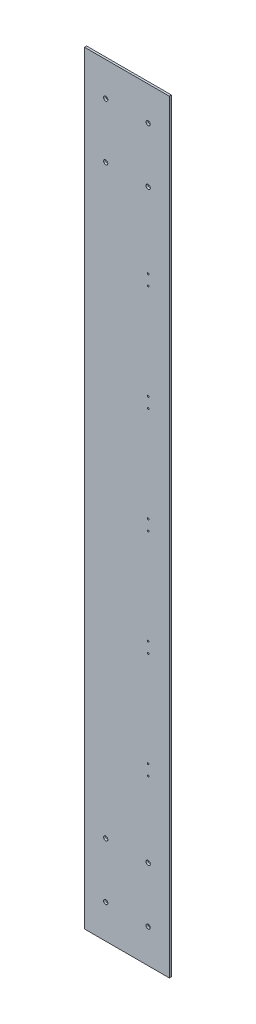
ISO-10303-21;
HEADER;
FILE_DESCRIPTION(('STEP AP214'),'2;1');
FILE_NAME('part.step','',(''),(''),'','','');
FILE_SCHEMA(('AUTOMOTIVE_DESIGN { 1 0 10303 214 1 1 1 1 }'));
ENDSEC;
DATA;
#1=APPLICATION_CONTEXT('core data for automotive mechanical design processes');
#2=APPLICATION_PROTOCOL_DEFINITION('international standard','automotive_design',2000,#1);
#3=PRODUCT_CONTEXT('',#1,'mechanical');
#4=PRODUCT('Part','Part','',(#3));
#5=PRODUCT_RELATED_PRODUCT_CATEGORY('part','',(#4));
#6=PRODUCT_DEFINITION_FORMATION('','',#4);
#7=PRODUCT_DEFINITION_CONTEXT('part definition',#1,'design');
#8=PRODUCT_DEFINITION('design','',#6,#7);
#9=PRODUCT_DEFINITION_SHAPE('','',#8);
#10=(LENGTH_UNIT() NAMED_UNIT(*) SI_UNIT(.MILLI.,.METRE.));
#11=(NAMED_UNIT(*) PLANE_ANGLE_UNIT() SI_UNIT($,.RADIAN.));
#12=(NAMED_UNIT(*) SI_UNIT($,.STERADIAN.) SOLID_ANGLE_UNIT());
#13=UNCERTAINTY_MEASURE_WITH_UNIT(LENGTH_MEASURE(1.E-05),#10,'distance_accuracy_value','');
#14=(GEOMETRIC_REPRESENTATION_CONTEXT(3) GLOBAL_UNCERTAINTY_ASSIGNED_CONTEXT((#13)) GLOBAL_UNIT_ASSIGNED_CONTEXT((#10,
#11,#12)) REPRESENTATION_CONTEXT('',''));
#15=CARTESIAN_POINT('',(0.,0.,0.));
#16=DIRECTION('',(0.,0.,1.));
#17=DIRECTION('',(1.,0.,0.));
#18=AXIS2_PLACEMENT_3D('',#15,#16,#17);
#19=CARTESIAN_POINT('',(100.,900.,5.));
#20=DIRECTION('',(0.,-1.,0.));
#21=DIRECTION('',(0.,0.,-1.));
#22=AXIS2_PLACEMENT_3D('',#19,#20,#21);
#23=PLANE('',#22);
#24=DIRECTION('',(-1.,0.,0.));
#25=VECTOR('',#24,1.);
#26=CARTESIAN_POINT('',(100.,900.,0.));
#27=LINE('',#26,#25);
#28=CARTESIAN_POINT('',(100.,900.,0.));
#29=VERTEX_POINT('',#28);
#30=CARTESIAN_POINT('',(-100.,900.,0.));
#31=VERTEX_POINT('',#30);
#32=EDGE_CURVE('E107',#29,#31,#27,.T.);
#33=ORIENTED_EDGE('',*,*,#32,.T.);
#34=DIRECTION('',(0.,0.,-1.));
#35=VECTOR('',#34,1.);
#36=CARTESIAN_POINT('',(-100.,900.,5.));
#37=LINE('',#36,#35);
#38=CARTESIAN_POINT('',(-100.,900.,5.));
#39=VERTEX_POINT('',#38);
#40=EDGE_CURVE('E11',#39,#31,#37,.T.);
#41=ORIENTED_EDGE('',*,*,#40,.F.);
#42=DIRECTION('',(-1.,0.,0.));
#43=VECTOR('',#42,1.);
#44=CARTESIAN_POINT('',(100.,900.,5.));
#45=LINE('',#44,#43);
#46=CARTESIAN_POINT('',(100.,900.,5.));
#47=VERTEX_POINT('',#46);
#48=EDGE_CURVE('E91',#47,#39,#45,.T.);
#49=ORIENTED_EDGE('',*,*,#48,.F.);
#50=DIRECTION('',(0.,0.,-1.));
#51=VECTOR('',#50,1.);
#52=CARTESIAN_POINT('',(100.,900.,5.));
#53=LINE('',#52,#51);
#54=EDGE_CURVE('E103',#47,#29,#53,.T.);
#55=ORIENTED_EDGE('',*,*,#54,.T.);
#56=EDGE_LOOP('',(#33,#41,#49,#55));
#57=FACE_BOUND('',#56,.T.);
#58=ADVANCED_FACE('F39',(#57),#23,.F.);
#59=CARTESIAN_POINT('',(-100.,900.,5.));
#60=DIRECTION('',(1.,0.,0.));
#61=DIRECTION('',(0.,0.,-1.));
#62=AXIS2_PLACEMENT_3D('',#59,#60,#61);
#63=PLANE('',#62);
#64=DIRECTION('',(0.,-1.,0.));
#65=VECTOR('',#64,1.);
#66=CARTESIAN_POINT('',(-100.,900.,0.));
#67=LINE('',#66,#65);
#68=CARTESIAN_POINT('',(-100.,-900.,0.));
#69=VERTEX_POINT('',#68);
#70=EDGE_CURVE('E96',#31,#69,#67,.T.);
#71=ORIENTED_EDGE('',*,*,#70,.T.);
#72=DIRECTION('',(0.,0.,-1.));
#73=VECTOR('',#72,1.);
#74=CARTESIAN_POINT('',(-100.,-900.,5.));
#75=LINE('',#74,#73);
#76=CARTESIAN_POINT('',(-100.,-900.,5.));
#77=VERTEX_POINT('',#76);
#78=EDGE_CURVE('E48',#77,#69,#75,.T.);
#79=ORIENTED_EDGE('',*,*,#78,.F.);
#80=DIRECTION('',(0.,-1.,0.));
#81=VECTOR('',#80,1.);
#82=CARTESIAN_POINT('',(-100.,900.,5.));
#83=LINE('',#82,#81);
#84=EDGE_CURVE('E86',#39,#77,#83,.T.);
#85=ORIENTED_EDGE('',*,*,#84,.F.);
#86=ORIENTED_EDGE('',*,*,#40,.T.);
#87=EDGE_LOOP('',(#71,#79,#85,#86));
#88=FACE_BOUND('',#87,.T.);
#89=ADVANCED_FACE('F95',(#88),#63,.F.);
#90=CARTESIAN_POINT('',(-100.,-900.,5.));
#91=DIRECTION('',(0.,1.,0.));
#92=DIRECTION('',(0.,0.,1.));
#93=AXIS2_PLACEMENT_3D('',#90,#91,#92);
#94=PLANE('',#93);
#95=DIRECTION('',(1.,0.,0.));
#96=VECTOR('',#95,1.);
#97=CARTESIAN_POINT('',(-100.,-900.,0.));
#98=LINE('',#97,#96);
#99=CARTESIAN_POINT('',(100.,-900.,0.));
#100=VERTEX_POINT('',#99);
#101=EDGE_CURVE('E73',#69,#100,#98,.T.);
#102=ORIENTED_EDGE('',*,*,#101,.T.);
#103=DIRECTION('',(0.,0.,-1.));
#104=VECTOR('',#103,1.);
#105=CARTESIAN_POINT('',(100.,-900.,5.));
#106=LINE('',#105,#104);
#107=CARTESIAN_POINT('',(100.,-900.,5.));
#108=VERTEX_POINT('',#107);
#109=EDGE_CURVE('E98',#108,#100,#106,.T.);
#110=ORIENTED_EDGE('',*,*,#109,.F.);
#111=DIRECTION('',(1.,0.,0.));
#112=VECTOR('',#111,1.);
#113=CARTESIAN_POINT('',(-100.,-900.,5.));
#114=LINE('',#113,#112);
#115=EDGE_CURVE('E89',#77,#108,#114,.T.);
#116=ORIENTED_EDGE('',*,*,#115,.F.);
#117=ORIENTED_EDGE('',*,*,#78,.T.);
#118=EDGE_LOOP('',(#102,#110,#116,#117));
#119=FACE_BOUND('',#118,.T.);
#120=ADVANCED_FACE('F99',(#119),#94,.F.);
#121=CARTESIAN_POINT('',(100.,-900.,5.));
#122=DIRECTION('',(-1.,0.,0.));
#123=DIRECTION('',(0.,0.,1.));
#124=AXIS2_PLACEMENT_3D('',#121,#122,#123);
#125=PLANE('',#124);
#126=DIRECTION('',(0.,1.,0.));
#127=VECTOR('',#126,1.);
#128=CARTESIAN_POINT('',(100.,-900.,0.));
#129=LINE('',#128,#127);
#130=EDGE_CURVE('E79',#100,#29,#129,.T.);
#131=ORIENTED_EDGE('',*,*,#130,.T.);
#132=ORIENTED_EDGE('',*,*,#54,.F.);
#133=DIRECTION('',(0.,1.,0.));
#134=VECTOR('',#133,1.);
#135=CARTESIAN_POINT('',(100.,-900.,5.));
#136=LINE('',#135,#134);
#137=EDGE_CURVE('E56',#108,#47,#136,.T.);
#138=ORIENTED_EDGE('',*,*,#137,.F.);
#139=ORIENTED_EDGE('',*,*,#109,.T.);
#140=EDGE_LOOP('',(#131,#132,#138,#139));
#141=FACE_BOUND('',#140,.T.);
#142=ADVANCED_FACE('F121',(#141),#125,.F.);
#143=CARTESIAN_POINT('',(0.,0.,5.));
#144=DIRECTION('',(0.,0.,1.));
#145=DIRECTION('',(1.,0.,0.));
#146=AXIS2_PLACEMENT_3D('',#143,#144,#145);
#147=PLANE('',#146);
#148=CARTESIAN_POINT('',(50.,-487.5,5.));
#149=DIRECTION('',(0.,0.,1.));
#150=DIRECTION('',(-1.,0.,0.));
#151=AXIS2_PLACEMENT_3D('',#148,#149,#150);
#152=CIRCLE('',#151,2.);
#153=CARTESIAN_POINT('',(48.,-487.5,5.));
#154=VERTEX_POINT('',#153);
#155=EDGE_CURVE('E200',#154,#154,#152,.T.);
#156=ORIENTED_EDGE('',*,*,#155,.F.);
#157=EDGE_LOOP('',(#156));
#158=FACE_BOUND('',#157,.T.);
#159=CARTESIAN_POINT('',(50.,-262.5,5.));
#160=DIRECTION('',(0.,0.,1.));
#161=DIRECTION('',(-1.,0.,0.));
#162=AXIS2_PLACEMENT_3D('',#159,#160,#161);
#163=CIRCLE('',#162,2.00000000000002);
#164=CARTESIAN_POINT('',(48.,-262.5,5.));
#165=VERTEX_POINT('',#164);
#166=EDGE_CURVE('E209',#165,#165,#163,.T.);
#167=ORIENTED_EDGE('',*,*,#166,.F.);
#168=EDGE_LOOP('',(#167));
#169=FACE_BOUND('',#168,.T.);
#170=CARTESIAN_POINT('',(50.,-237.5,5.));
#171=DIRECTION('',(0.,0.,1.));
#172=DIRECTION('',(-1.,0.,0.));
#173=AXIS2_PLACEMENT_3D('',#170,#171,#172);
#174=CIRCLE('',#173,2.);
#175=CARTESIAN_POINT('',(48.,-237.5,5.));
#176=VERTEX_POINT('',#175);
#177=EDGE_CURVE('E217',#176,#176,#174,.T.);
#178=ORIENTED_EDGE('',*,*,#177,.F.);
#179=EDGE_LOOP('',(#178));
#180=FACE_BOUND('',#179,.T.);
#181=CARTESIAN_POINT('',(50.,-12.5,5.));
#182=DIRECTION('',(0.,0.,1.));
#183=DIRECTION('',(-1.,0.,0.));
#184=AXIS2_PLACEMENT_3D('',#181,#182,#183);
#185=CIRCLE('',#184,2.);
#186=CARTESIAN_POINT('',(48.,-12.5,5.));
#187=VERTEX_POINT('',#186);
#188=EDGE_CURVE('E225',#187,#187,#185,.T.);
#189=ORIENTED_EDGE('',*,*,#188,.F.);
#190=EDGE_LOOP('',(#189));
#191=FACE_BOUND('',#190,.T.);
#192=CARTESIAN_POINT('',(50.,12.5,5.));
#193=DIRECTION('',(0.,0.,1.));
#194=DIRECTION('',(1.,0.,0.));
#195=AXIS2_PLACEMENT_3D('',#192,#193,#194);
#196=CIRCLE('',#195,2.);
#197=CARTESIAN_POINT('',(52.,12.5,5.));
#198=VERTEX_POINT('',#197);
#199=EDGE_CURVE('E233',#198,#198,#196,.T.);
#200=ORIENTED_EDGE('',*,*,#199,.F.);
#201=EDGE_LOOP('',(#200));
#202=FACE_BOUND('',#201,.T.);
#203=CARTESIAN_POINT('',(50.,237.5,5.));
#204=DIRECTION('',(0.,0.,1.));
#205=DIRECTION('',(1.,0.,0.));
#206=AXIS2_PLACEMENT_3D('',#203,#204,#205);
#207=CIRCLE('',#206,2.);
#208=CARTESIAN_POINT('',(52.,237.5,5.));
#209=VERTEX_POINT('',#208);
#210=EDGE_CURVE('E241',#209,#209,#207,.T.);
#211=ORIENTED_EDGE('',*,*,#210,.F.);
#212=EDGE_LOOP('',(#211));
#213=FACE_BOUND('',#212,.T.);
#214=CARTESIAN_POINT('',(-50.,690.,5.));
#215=DIRECTION('',(0.,0.,1.));
#216=DIRECTION('',(-1.,0.,0.));
#217=AXIS2_PLACEMENT_3D('',#214,#215,#216);
#218=CIRCLE('',#217,4.99999999999999);
#219=CARTESIAN_POINT('',(-55.,690.,5.));
#220=VERTEX_POINT('',#219);
#221=EDGE_CURVE('E249',#220,#220,#218,.T.);
#222=ORIENTED_EDGE('',*,*,#221,.F.);
#223=EDGE_LOOP('',(#222));
#224=FACE_BOUND('',#223,.T.);
#225=CARTESIAN_POINT('',(50.,690.,5.));
#226=DIRECTION('',(0.,0.,1.));
#227=DIRECTION('',(-1.,0.,0.));
#228=AXIS2_PLACEMENT_3D('',#225,#226,#227);
#229=CIRCLE('',#228,5.00000000000001);
#230=CARTESIAN_POINT('',(45.,690.,5.));
#231=VERTEX_POINT('',#230);
#232=EDGE_CURVE('E257',#231,#231,#229,.T.);
#233=ORIENTED_EDGE('',*,*,#232,.F.);
#234=EDGE_LOOP('',(#233));
#235=FACE_BOUND('',#234,.T.);
#236=CARTESIAN_POINT('',(50.,487.5,5.));
#237=DIRECTION('',(0.,0.,1.));
#238=DIRECTION('',(1.,0.,0.));
#239=AXIS2_PLACEMENT_3D('',#236,#237,#238);
#240=CIRCLE('',#239,2.);
#241=CARTESIAN_POINT('',(52.,487.5,5.));
#242=VERTEX_POINT('',#241);
#243=EDGE_CURVE('E161',#242,#242,#240,.T.);
#244=ORIENTED_EDGE('',*,*,#243,.F.);
#245=EDGE_LOOP('',(#244));
#246=FACE_BOUND('',#245,.T.);
#247=CARTESIAN_POINT('',(50.,262.5,5.));
#248=DIRECTION('',(0.,0.,1.));
#249=DIRECTION('',(1.,0.,0.));
#250=AXIS2_PLACEMENT_3D('',#247,#248,#249);
#251=CIRCLE('',#250,2.00000000000002);
#252=CARTESIAN_POINT('',(52.,262.5,5.));
#253=VERTEX_POINT('',#252);
#254=EDGE_CURVE('E153',#253,#253,#251,.T.);
#255=ORIENTED_EDGE('',*,*,#254,.F.);
#256=EDGE_LOOP('',(#255));
#257=FACE_BOUND('',#256,.T.);
#258=CARTESIAN_POINT('',(-50.,-690.,5.));
#259=DIRECTION('',(0.,0.,1.));
#260=DIRECTION('',(1.,0.,0.));
#261=AXIS2_PLACEMENT_3D('',#258,#259,#260);
#262=CIRCLE('',#261,4.99999999999999);
#263=CARTESIAN_POINT('',(-45.,-690.,5.));
#264=VERTEX_POINT('',#263);
#265=EDGE_CURVE('E145',#264,#264,#262,.T.);
#266=ORIENTED_EDGE('',*,*,#265,.F.);
#267=EDGE_LOOP('',(#266));
#268=FACE_BOUND('',#267,.T.);
#269=CARTESIAN_POINT('',(50.,-690.,5.));
#270=DIRECTION('',(0.,0.,1.));
#271=DIRECTION('',(1.,0.,0.));
#272=AXIS2_PLACEMENT_3D('',#269,#270,#271);
#273=CIRCLE('',#272,5.00000000000001);
#274=CARTESIAN_POINT('',(55.,-690.,5.));
#275=VERTEX_POINT('',#274);
#276=EDGE_CURVE('E136',#275,#275,#273,.T.);
#277=ORIENTED_EDGE('',*,*,#276,.F.);
#278=EDGE_LOOP('',(#277));
#279=FACE_BOUND('',#278,.T.);
#280=CARTESIAN_POINT('',(-50.,-820.,5.));
#281=DIRECTION('',(0.,0.,1.));
#282=DIRECTION('',(1.,0.,0.));
#283=AXIS2_PLACEMENT_3D('',#280,#281,#282);
#284=CIRCLE('',#283,4.99999999999998);
#285=CARTESIAN_POINT('',(-45.,-820.,5.));
#286=VERTEX_POINT('',#285);
#287=EDGE_CURVE('E193',#286,#286,#284,.T.);
#288=ORIENTED_EDGE('',*,*,#287,.F.);
#289=EDGE_LOOP('',(#288));
#290=FACE_BOUND('',#289,.T.);
#291=CARTESIAN_POINT('',(50.,-820.,5.));
#292=DIRECTION('',(0.,0.,1.));
#293=DIRECTION('',(1.,0.,0.));
#294=AXIS2_PLACEMENT_3D('',#291,#292,#293);
#295=CIRCLE('',#294,5.00000000000001);
#296=CARTESIAN_POINT('',(55.,-820.,5.));
#297=VERTEX_POINT('',#296);
#298=EDGE_CURVE('E185',#297,#297,#295,.T.);
#299=ORIENTED_EDGE('',*,*,#298,.F.);
#300=EDGE_LOOP('',(#299));
#301=FACE_BOUND('',#300,.T.);
#302=CARTESIAN_POINT('',(50.,820.,5.));
#303=DIRECTION('',(0.,0.,1.));
#304=DIRECTION('',(-1.,0.,0.));
#305=AXIS2_PLACEMENT_3D('',#302,#303,#304);
#306=CIRCLE('',#305,5.00000000000001);
#307=CARTESIAN_POINT('',(45.,820.,5.));
#308=VERTEX_POINT('',#307);
#309=EDGE_CURVE('E177',#308,#308,#306,.T.);
#310=ORIENTED_EDGE('',*,*,#309,.F.);
#311=EDGE_LOOP('',(#310));
#312=FACE_BOUND('',#311,.T.);
#313=CARTESIAN_POINT('',(-50.,820.,5.));
#314=DIRECTION('',(0.,0.,1.));
#315=DIRECTION('',(-1.,0.,0.));
#316=AXIS2_PLACEMENT_3D('',#313,#314,#315);
#317=CIRCLE('',#316,4.99999999999998);
#318=CARTESIAN_POINT('',(-55.,820.,5.));
#319=VERTEX_POINT('',#318);
#320=EDGE_CURVE('E168',#319,#319,#317,.T.);
#321=ORIENTED_EDGE('',*,*,#320,.F.);
#322=EDGE_LOOP('',(#321));
#323=FACE_BOUND('',#322,.T.);
#324=CARTESIAN_POINT('',(50.,-512.5,5.));
#325=DIRECTION('',(0.,0.,1.));
#326=DIRECTION('',(-1.,0.,0.));
#327=AXIS2_PLACEMENT_3D('',#324,#325,#326);
#328=CIRCLE('',#327,2.00000000000003);
#329=CARTESIAN_POINT('',(48.,-512.5,5.));
#330=VERTEX_POINT('',#329);
#331=EDGE_CURVE('E264',#330,#330,#328,.T.);
#332=ORIENTED_EDGE('',*,*,#331,.F.);
#333=EDGE_LOOP('',(#332));
#334=FACE_BOUND('',#333,.T.);
#335=CARTESIAN_POINT('',(50.,512.5,5.));
#336=DIRECTION('',(0.,0.,1.));
#337=DIRECTION('',(1.,0.,0.));
#338=AXIS2_PLACEMENT_3D('',#335,#336,#337);
#339=CIRCLE('',#338,2.00000000000003);
#340=CARTESIAN_POINT('',(52.,512.5,5.));
#341=VERTEX_POINT('',#340);
#342=EDGE_CURVE('E128',#341,#341,#339,.T.);
#343=ORIENTED_EDGE('',*,*,#342,.F.);
#344=EDGE_LOOP('',(#343));
#345=FACE_BOUND('',#344,.T.);
#346=ORIENTED_EDGE('',*,*,#48,.T.);
#347=ORIENTED_EDGE('',*,*,#84,.T.);
#348=ORIENTED_EDGE('',*,*,#115,.T.);
#349=ORIENTED_EDGE('',*,*,#137,.T.);
#350=EDGE_LOOP('',(#346,#347,#348,#349));
#351=FACE_BOUND('',#350,.T.);
#352=ADVANCED_FACE('F87',(#158,#169,#180,#191,#202,#213,#224,#235,#246,#257,#268,#279,#290,#301,
#312,#323,#334,#345,#351),#147,.T.);
#353=CARTESIAN_POINT('',(0.,0.,0.));
#354=DIRECTION('',(0.,0.,1.));
#355=DIRECTION('',(1.,0.,0.));
#356=AXIS2_PLACEMENT_3D('',#353,#354,#355);
#357=PLANE('',#356);
#358=CARTESIAN_POINT('',(50.,-487.5,0.));
#359=DIRECTION('',(0.,0.,1.));
#360=DIRECTION('',(-1.,0.,0.));
#361=AXIS2_PLACEMENT_3D('',#358,#359,#360);
#362=CIRCLE('',#361,2.);
#363=CARTESIAN_POINT('',(48.,-487.5,0.));
#364=VERTEX_POINT('',#363);
#365=EDGE_CURVE('E204',#364,#364,#362,.T.);
#366=ORIENTED_EDGE('',*,*,#365,.T.);
#367=EDGE_LOOP('',(#366));
#368=FACE_BOUND('',#367,.T.);
#369=CARTESIAN_POINT('',(50.,-262.5,0.));
#370=DIRECTION('',(0.,0.,1.));
#371=DIRECTION('',(-1.,0.,0.));
#372=AXIS2_PLACEMENT_3D('',#369,#370,#371);
#373=CIRCLE('',#372,2.00000000000002);
#374=CARTESIAN_POINT('',(48.,-262.5,0.));
#375=VERTEX_POINT('',#374);
#376=EDGE_CURVE('E213',#375,#375,#373,.T.);
#377=ORIENTED_EDGE('',*,*,#376,.T.);
#378=EDGE_LOOP('',(#377));
#379=FACE_BOUND('',#378,.T.);
#380=CARTESIAN_POINT('',(50.,-237.5,0.));
#381=DIRECTION('',(0.,0.,1.));
#382=DIRECTION('',(-1.,0.,0.));
#383=AXIS2_PLACEMENT_3D('',#380,#381,#382);
#384=CIRCLE('',#383,2.);
#385=CARTESIAN_POINT('',(48.,-237.5,0.));
#386=VERTEX_POINT('',#385);
#387=EDGE_CURVE('E221',#386,#386,#384,.T.);
#388=ORIENTED_EDGE('',*,*,#387,.T.);
#389=EDGE_LOOP('',(#388));
#390=FACE_BOUND('',#389,.T.);
#391=CARTESIAN_POINT('',(50.,-12.5,0.));
#392=DIRECTION('',(0.,0.,1.));
#393=DIRECTION('',(-1.,0.,0.));
#394=AXIS2_PLACEMENT_3D('',#391,#392,#393);
#395=CIRCLE('',#394,2.);
#396=CARTESIAN_POINT('',(48.,-12.5,0.));
#397=VERTEX_POINT('',#396);
#398=EDGE_CURVE('E229',#397,#397,#395,.T.);
#399=ORIENTED_EDGE('',*,*,#398,.T.);
#400=EDGE_LOOP('',(#399));
#401=FACE_BOUND('',#400,.T.);
#402=CARTESIAN_POINT('',(50.,12.5,0.));
#403=DIRECTION('',(0.,0.,1.));
#404=DIRECTION('',(1.,0.,0.));
#405=AXIS2_PLACEMENT_3D('',#402,#403,#404);
#406=CIRCLE('',#405,2.);
#407=CARTESIAN_POINT('',(52.,12.5,0.));
#408=VERTEX_POINT('',#407);
#409=EDGE_CURVE('E237',#408,#408,#406,.T.);
#410=ORIENTED_EDGE('',*,*,#409,.T.);
#411=EDGE_LOOP('',(#410));
#412=FACE_BOUND('',#411,.T.);
#413=CARTESIAN_POINT('',(50.,237.5,0.));
#414=DIRECTION('',(0.,0.,1.));
#415=DIRECTION('',(1.,0.,0.));
#416=AXIS2_PLACEMENT_3D('',#413,#414,#415);
#417=CIRCLE('',#416,2.);
#418=CARTESIAN_POINT('',(52.,237.5,0.));
#419=VERTEX_POINT('',#418);
#420=EDGE_CURVE('E245',#419,#419,#417,.T.);
#421=ORIENTED_EDGE('',*,*,#420,.T.);
#422=EDGE_LOOP('',(#421));
#423=FACE_BOUND('',#422,.T.);
#424=CARTESIAN_POINT('',(-50.,690.,0.));
#425=DIRECTION('',(0.,0.,1.));
#426=DIRECTION('',(-1.,0.,0.));
#427=AXIS2_PLACEMENT_3D('',#424,#425,#426);
#428=CIRCLE('',#427,4.99999999999999);
#429=CARTESIAN_POINT('',(-55.,690.,0.));
#430=VERTEX_POINT('',#429);
#431=EDGE_CURVE('E253',#430,#430,#428,.T.);
#432=ORIENTED_EDGE('',*,*,#431,.T.);
#433=EDGE_LOOP('',(#432));
#434=FACE_BOUND('',#433,.T.);
#435=CARTESIAN_POINT('',(50.,690.,0.));
#436=DIRECTION('',(0.,0.,1.));
#437=DIRECTION('',(-1.,0.,0.));
#438=AXIS2_PLACEMENT_3D('',#435,#436,#437);
#439=CIRCLE('',#438,5.00000000000001);
#440=CARTESIAN_POINT('',(45.,690.,0.));
#441=VERTEX_POINT('',#440);
#442=EDGE_CURVE('E173',#441,#441,#439,.T.);
#443=ORIENTED_EDGE('',*,*,#442,.T.);
#444=EDGE_LOOP('',(#443));
#445=FACE_BOUND('',#444,.T.);
#446=CARTESIAN_POINT('',(50.,487.5,0.));
#447=DIRECTION('',(0.,0.,1.));
#448=DIRECTION('',(1.,0.,0.));
#449=AXIS2_PLACEMENT_3D('',#446,#447,#448);
#450=CIRCLE('',#449,2.);
#451=CARTESIAN_POINT('',(52.,487.5,0.));
#452=VERTEX_POINT('',#451);
#453=EDGE_CURVE('E132',#452,#452,#450,.T.);
#454=ORIENTED_EDGE('',*,*,#453,.T.);
#455=EDGE_LOOP('',(#454));
#456=FACE_BOUND('',#455,.T.);
#457=CARTESIAN_POINT('',(50.,262.5,0.));
#458=DIRECTION('',(0.,0.,1.));
#459=DIRECTION('',(1.,0.,0.));
#460=AXIS2_PLACEMENT_3D('',#457,#458,#459);
#461=CIRCLE('',#460,2.00000000000002);
#462=CARTESIAN_POINT('',(52.,262.5,0.));
#463=VERTEX_POINT('',#462);
#464=EDGE_CURVE('E157',#463,#463,#461,.T.);
#465=ORIENTED_EDGE('',*,*,#464,.T.);
#466=EDGE_LOOP('',(#465));
#467=FACE_BOUND('',#466,.T.);
#468=CARTESIAN_POINT('',(-50.,-690.,0.));
#469=DIRECTION('',(0.,0.,1.));
#470=DIRECTION('',(1.,0.,0.));
#471=AXIS2_PLACEMENT_3D('',#468,#469,#470);
#472=CIRCLE('',#471,4.99999999999999);
#473=CARTESIAN_POINT('',(-45.,-690.,0.));
#474=VERTEX_POINT('',#473);
#475=EDGE_CURVE('E149',#474,#474,#472,.T.);
#476=ORIENTED_EDGE('',*,*,#475,.T.);
#477=EDGE_LOOP('',(#476));
#478=FACE_BOUND('',#477,.T.);
#479=CARTESIAN_POINT('',(50.,-690.,0.));
#480=DIRECTION('',(0.,0.,1.));
#481=DIRECTION('',(1.,0.,0.));
#482=AXIS2_PLACEMENT_3D('',#479,#480,#481);
#483=CIRCLE('',#482,5.00000000000001);
#484=CARTESIAN_POINT('',(55.,-690.,0.));
#485=VERTEX_POINT('',#484);
#486=EDGE_CURVE('E140',#485,#485,#483,.T.);
#487=ORIENTED_EDGE('',*,*,#486,.T.);
#488=EDGE_LOOP('',(#487));
#489=FACE_BOUND('',#488,.T.);
#490=CARTESIAN_POINT('',(-50.,-820.,0.));
#491=DIRECTION('',(0.,0.,1.));
#492=DIRECTION('',(1.,0.,0.));
#493=AXIS2_PLACEMENT_3D('',#490,#491,#492);
#494=CIRCLE('',#493,4.99999999999998);
#495=CARTESIAN_POINT('',(-45.,-820.,0.));
#496=VERTEX_POINT('',#495);
#497=EDGE_CURVE('E141',#496,#496,#494,.T.);
#498=ORIENTED_EDGE('',*,*,#497,.T.);
#499=EDGE_LOOP('',(#498));
#500=FACE_BOUND('',#499,.T.);
#501=CARTESIAN_POINT('',(50.,-820.,0.));
#502=DIRECTION('',(0.,0.,1.));
#503=DIRECTION('',(1.,0.,0.));
#504=AXIS2_PLACEMENT_3D('',#501,#502,#503);
#505=CIRCLE('',#504,5.00000000000001);
#506=CARTESIAN_POINT('',(55.,-820.,0.));
#507=VERTEX_POINT('',#506);
#508=EDGE_CURVE('E189',#507,#507,#505,.T.);
#509=ORIENTED_EDGE('',*,*,#508,.T.);
#510=EDGE_LOOP('',(#509));
#511=FACE_BOUND('',#510,.T.);
#512=CARTESIAN_POINT('',(50.,820.,0.));
#513=DIRECTION('',(0.,0.,1.));
#514=DIRECTION('',(-1.,0.,0.));
#515=AXIS2_PLACEMENT_3D('',#512,#513,#514);
#516=CIRCLE('',#515,5.00000000000001);
#517=CARTESIAN_POINT('',(45.,820.,0.));
#518=VERTEX_POINT('',#517);
#519=EDGE_CURVE('E181',#518,#518,#516,.T.);
#520=ORIENTED_EDGE('',*,*,#519,.T.);
#521=EDGE_LOOP('',(#520));
#522=FACE_BOUND('',#521,.T.);
#523=CARTESIAN_POINT('',(-50.,820.,0.));
#524=DIRECTION('',(0.,0.,1.));
#525=DIRECTION('',(-1.,0.,0.));
#526=AXIS2_PLACEMENT_3D('',#523,#524,#525);
#527=CIRCLE('',#526,4.99999999999998);
#528=CARTESIAN_POINT('',(-55.,820.,0.));
#529=VERTEX_POINT('',#528);
#530=EDGE_CURVE('E172',#529,#529,#527,.T.);
#531=ORIENTED_EDGE('',*,*,#530,.T.);
#532=EDGE_LOOP('',(#531));
#533=FACE_BOUND('',#532,.T.);
#534=CARTESIAN_POINT('',(50.,-512.5,0.));
#535=DIRECTION('',(0.,0.,1.));
#536=DIRECTION('',(-1.,0.,0.));
#537=AXIS2_PLACEMENT_3D('',#534,#535,#536);
#538=CIRCLE('',#537,2.00000000000003);
#539=CARTESIAN_POINT('',(48.,-512.5,0.));
#540=VERTEX_POINT('',#539);
#541=EDGE_CURVE('E205',#540,#540,#538,.T.);
#542=ORIENTED_EDGE('',*,*,#541,.T.);
#543=EDGE_LOOP('',(#542));
#544=FACE_BOUND('',#543,.T.);
#545=CARTESIAN_POINT('',(50.,512.5,0.));
#546=DIRECTION('',(0.,0.,1.));
#547=DIRECTION('',(1.,0.,0.));
#548=AXIS2_PLACEMENT_3D('',#545,#546,#547);
#549=CIRCLE('',#548,2.00000000000003);
#550=CARTESIAN_POINT('',(52.,512.5,0.));
#551=VERTEX_POINT('',#550);
#552=EDGE_CURVE('E111',#551,#551,#549,.T.);
#553=ORIENTED_EDGE('',*,*,#552,.T.);
#554=EDGE_LOOP('',(#553));
#555=FACE_BOUND('',#554,.T.);
#556=ORIENTED_EDGE('',*,*,#32,.F.);
#557=ORIENTED_EDGE('',*,*,#130,.F.);
#558=ORIENTED_EDGE('',*,*,#101,.F.);
#559=ORIENTED_EDGE('',*,*,#70,.F.);
#560=EDGE_LOOP('',(#556,#557,#558,#559));
#561=FACE_BOUND('',#560,.T.);
#562=ADVANCED_FACE('F124',(#368,#379,#390,#401,#412,#423,#434,#445,#456,#467,#478,#489,#500,
#511,#522,#533,#544,#555,#561),#357,.F.);
#563=CARTESIAN_POINT('',(50.,512.5,0.));
#564=DIRECTION('',(0.,0.,1.));
#565=DIRECTION('',(1.,0.,0.));
#566=AXIS2_PLACEMENT_3D('',#563,#564,#565);
#567=CYLINDRICAL_SURFACE('',#566,2.00000000000003);
#568=ORIENTED_EDGE('',*,*,#552,.F.);
#569=EDGE_LOOP('',(#568));
#570=FACE_BOUND('',#569,.T.);
#571=ORIENTED_EDGE('',*,*,#342,.T.);
#572=EDGE_LOOP('',(#571));
#573=FACE_BOUND('',#572,.T.);
#574=ADVANCED_FACE('F278',(#570,#573),#567,.F.);
#575=CARTESIAN_POINT('',(50.,-512.5,0.));
#576=DIRECTION('',(0.,0.,1.));
#577=DIRECTION('',(1.,0.,0.));
#578=AXIS2_PLACEMENT_3D('',#575,#576,#577);
#579=CYLINDRICAL_SURFACE('',#578,2.00000000000003);
#580=ORIENTED_EDGE('',*,*,#541,.F.);
#581=EDGE_LOOP('',(#580));
#582=FACE_BOUND('',#581,.T.);
#583=ORIENTED_EDGE('',*,*,#331,.T.);
#584=EDGE_LOOP('',(#583));
#585=FACE_BOUND('',#584,.T.);
#586=ADVANCED_FACE('F274',(#582,#585),#579,.F.);
#587=CARTESIAN_POINT('',(-50.,820.,0.));
#588=DIRECTION('',(0.,0.,1.));
#589=DIRECTION('',(1.,0.,0.));
#590=AXIS2_PLACEMENT_3D('',#587,#588,#589);
#591=CYLINDRICAL_SURFACE('',#590,4.99999999999998);
#592=ORIENTED_EDGE('',*,*,#530,.F.);
#593=EDGE_LOOP('',(#592));
#594=FACE_BOUND('',#593,.T.);
#595=ORIENTED_EDGE('',*,*,#320,.T.);
#596=EDGE_LOOP('',(#595));
#597=FACE_BOUND('',#596,.T.);
#598=ADVANCED_FACE('F277',(#594,#597),#591,.F.);
#599=CARTESIAN_POINT('',(50.,820.,0.));
#600=DIRECTION('',(0.,0.,1.));
#601=DIRECTION('',(1.,0.,0.));
#602=AXIS2_PLACEMENT_3D('',#599,#600,#601);
#603=CYLINDRICAL_SURFACE('',#602,5.00000000000001);
#604=ORIENTED_EDGE('',*,*,#519,.F.);
#605=EDGE_LOOP('',(#604));
#606=FACE_BOUND('',#605,.T.);
#607=ORIENTED_EDGE('',*,*,#309,.T.);
#608=EDGE_LOOP('',(#607));
#609=FACE_BOUND('',#608,.T.);
#610=ADVANCED_FACE('F339',(#606,#609),#603,.F.);
#611=CARTESIAN_POINT('',(50.,-820.,0.));
#612=DIRECTION('',(0.,0.,1.));
#613=DIRECTION('',(1.,0.,0.));
#614=AXIS2_PLACEMENT_3D('',#611,#612,#613);
#615=CYLINDRICAL_SURFACE('',#614,5.00000000000001);
#616=ORIENTED_EDGE('',*,*,#508,.F.);
#617=EDGE_LOOP('',(#616));
#618=FACE_BOUND('',#617,.T.);
#619=ORIENTED_EDGE('',*,*,#298,.T.);
#620=EDGE_LOOP('',(#619));
#621=FACE_BOUND('',#620,.T.);
#622=ADVANCED_FACE('F349',(#618,#621),#615,.F.);
#623=CARTESIAN_POINT('',(-50.,-820.,0.));
#624=DIRECTION('',(0.,0.,1.));
#625=DIRECTION('',(1.,0.,0.));
#626=AXIS2_PLACEMENT_3D('',#623,#624,#625);
#627=CYLINDRICAL_SURFACE('',#626,4.99999999999998);
#628=ORIENTED_EDGE('',*,*,#497,.F.);
#629=EDGE_LOOP('',(#628));
#630=FACE_BOUND('',#629,.T.);
#631=ORIENTED_EDGE('',*,*,#287,.T.);
#632=EDGE_LOOP('',(#631));
#633=FACE_BOUND('',#632,.T.);
#634=ADVANCED_FACE('F359',(#630,#633),#627,.F.);
#635=CARTESIAN_POINT('',(50.,-690.,0.));
#636=DIRECTION('',(0.,0.,1.));
#637=DIRECTION('',(1.,0.,0.));
#638=AXIS2_PLACEMENT_3D('',#635,#636,#637);
#639=CYLINDRICAL_SURFACE('',#638,5.00000000000001);
#640=ORIENTED_EDGE('',*,*,#486,.F.);
#641=EDGE_LOOP('',(#640));
#642=FACE_BOUND('',#641,.T.);
#643=ORIENTED_EDGE('',*,*,#276,.T.);
#644=EDGE_LOOP('',(#643));
#645=FACE_BOUND('',#644,.T.);
#646=ADVANCED_FACE('F369',(#642,#645),#639,.F.);
#647=CARTESIAN_POINT('',(-50.,-690.,0.));
#648=DIRECTION('',(0.,0.,1.));
#649=DIRECTION('',(1.,0.,0.));
#650=AXIS2_PLACEMENT_3D('',#647,#648,#649);
#651=CYLINDRICAL_SURFACE('',#650,4.99999999999999);
#652=ORIENTED_EDGE('',*,*,#475,.F.);
#653=EDGE_LOOP('',(#652));
#654=FACE_BOUND('',#653,.T.);
#655=ORIENTED_EDGE('',*,*,#265,.T.);
#656=EDGE_LOOP('',(#655));
#657=FACE_BOUND('',#656,.T.);
#658=ADVANCED_FACE('F379',(#654,#657),#651,.F.);
#659=CARTESIAN_POINT('',(50.,262.5,0.));
#660=DIRECTION('',(0.,0.,1.));
#661=DIRECTION('',(1.,0.,0.));
#662=AXIS2_PLACEMENT_3D('',#659,#660,#661);
#663=CYLINDRICAL_SURFACE('',#662,2.00000000000002);
#664=ORIENTED_EDGE('',*,*,#464,.F.);
#665=EDGE_LOOP('',(#664));
#666=FACE_BOUND('',#665,.T.);
#667=ORIENTED_EDGE('',*,*,#254,.T.);
#668=EDGE_LOOP('',(#667));
#669=FACE_BOUND('',#668,.T.);
#670=ADVANCED_FACE('F388',(#666,#669),#663,.F.);
#671=CARTESIAN_POINT('',(50.,487.5,0.));
#672=DIRECTION('',(0.,0.,1.));
#673=DIRECTION('',(1.,0.,0.));
#674=AXIS2_PLACEMENT_3D('',#671,#672,#673);
#675=CYLINDRICAL_SURFACE('',#674,2.);
#676=ORIENTED_EDGE('',*,*,#453,.F.);
#677=EDGE_LOOP('',(#676));
#678=FACE_BOUND('',#677,.T.);
#679=ORIENTED_EDGE('',*,*,#243,.T.);
#680=EDGE_LOOP('',(#679));
#681=FACE_BOUND('',#680,.T.);
#682=ADVANCED_FACE('F398',(#678,#681),#675,.F.);
#683=CARTESIAN_POINT('',(50.,690.,0.));
#684=DIRECTION('',(0.,0.,1.));
#685=DIRECTION('',(1.,0.,0.));
#686=AXIS2_PLACEMENT_3D('',#683,#684,#685);
#687=CYLINDRICAL_SURFACE('',#686,5.00000000000001);
#688=ORIENTED_EDGE('',*,*,#442,.F.);
#689=EDGE_LOOP('',(#688));
#690=FACE_BOUND('',#689,.T.);
#691=ORIENTED_EDGE('',*,*,#232,.T.);
#692=EDGE_LOOP('',(#691));
#693=FACE_BOUND('',#692,.T.);
#694=ADVANCED_FACE('F408',(#690,#693),#687,.F.);
#695=CARTESIAN_POINT('',(-50.,690.,0.));
#696=DIRECTION('',(0.,0.,1.));
#697=DIRECTION('',(1.,0.,0.));
#698=AXIS2_PLACEMENT_3D('',#695,#696,#697);
#699=CYLINDRICAL_SURFACE('',#698,4.99999999999999);
#700=ORIENTED_EDGE('',*,*,#431,.F.);
#701=EDGE_LOOP('',(#700));
#702=FACE_BOUND('',#701,.T.);
#703=ORIENTED_EDGE('',*,*,#221,.T.);
#704=EDGE_LOOP('',(#703));
#705=FACE_BOUND('',#704,.T.);
#706=ADVANCED_FACE('F418',(#702,#705),#699,.F.);
#707=CARTESIAN_POINT('',(50.,237.5,0.));
#708=DIRECTION('',(0.,0.,1.));
#709=DIRECTION('',(1.,0.,0.));
#710=AXIS2_PLACEMENT_3D('',#707,#708,#709);
#711=CYLINDRICAL_SURFACE('',#710,2.);
#712=ORIENTED_EDGE('',*,*,#420,.F.);
#713=EDGE_LOOP('',(#712));
#714=FACE_BOUND('',#713,.T.);
#715=ORIENTED_EDGE('',*,*,#210,.T.);
#716=EDGE_LOOP('',(#715));
#717=FACE_BOUND('',#716,.T.);
#718=ADVANCED_FACE('F428',(#714,#717),#711,.F.);
#719=CARTESIAN_POINT('',(50.,12.5,0.));
#720=DIRECTION('',(0.,0.,1.));
#721=DIRECTION('',(1.,0.,0.));
#722=AXIS2_PLACEMENT_3D('',#719,#720,#721);
#723=CYLINDRICAL_SURFACE('',#722,2.);
#724=ORIENTED_EDGE('',*,*,#409,.F.);
#725=EDGE_LOOP('',(#724));
#726=FACE_BOUND('',#725,.T.);
#727=ORIENTED_EDGE('',*,*,#199,.T.);
#728=EDGE_LOOP('',(#727));
#729=FACE_BOUND('',#728,.T.);
#730=ADVANCED_FACE('F438',(#726,#729),#723,.F.);
#731=CARTESIAN_POINT('',(50.,-12.5,0.));
#732=DIRECTION('',(0.,0.,1.));
#733=DIRECTION('',(1.,0.,0.));
#734=AXIS2_PLACEMENT_3D('',#731,#732,#733);
#735=CYLINDRICAL_SURFACE('',#734,2.);
#736=ORIENTED_EDGE('',*,*,#398,.F.);
#737=EDGE_LOOP('',(#736));
#738=FACE_BOUND('',#737,.T.);
#739=ORIENTED_EDGE('',*,*,#188,.T.);
#740=EDGE_LOOP('',(#739));
#741=FACE_BOUND('',#740,.T.);
#742=ADVANCED_FACE('F448',(#738,#741),#735,.F.);
#743=CARTESIAN_POINT('',(50.,-237.5,0.));
#744=DIRECTION('',(0.,0.,1.));
#745=DIRECTION('',(1.,0.,0.));
#746=AXIS2_PLACEMENT_3D('',#743,#744,#745);
#747=CYLINDRICAL_SURFACE('',#746,2.);
#748=ORIENTED_EDGE('',*,*,#387,.F.);
#749=EDGE_LOOP('',(#748));
#750=FACE_BOUND('',#749,.T.);
#751=ORIENTED_EDGE('',*,*,#177,.T.);
#752=EDGE_LOOP('',(#751));
#753=FACE_BOUND('',#752,.T.);
#754=ADVANCED_FACE('F458',(#750,#753),#747,.F.);
#755=CARTESIAN_POINT('',(50.,-262.5,0.));
#756=DIRECTION('',(0.,0.,1.));
#757=DIRECTION('',(1.,0.,0.));
#758=AXIS2_PLACEMENT_3D('',#755,#756,#757);
#759=CYLINDRICAL_SURFACE('',#758,2.00000000000002);
#760=ORIENTED_EDGE('',*,*,#376,.F.);
#761=EDGE_LOOP('',(#760));
#762=FACE_BOUND('',#761,.T.);
#763=ORIENTED_EDGE('',*,*,#166,.T.);
#764=EDGE_LOOP('',(#763));
#765=FACE_BOUND('',#764,.T.);
#766=ADVANCED_FACE('F468',(#762,#765),#759,.F.);
#767=CARTESIAN_POINT('',(50.,-487.5,0.));
#768=DIRECTION('',(0.,0.,1.));
#769=DIRECTION('',(1.,0.,0.));
#770=AXIS2_PLACEMENT_3D('',#767,#768,#769);
#771=CYLINDRICAL_SURFACE('',#770,2.);
#772=ORIENTED_EDGE('',*,*,#365,.F.);
#773=EDGE_LOOP('',(#772));
#774=FACE_BOUND('',#773,.T.);
#775=ORIENTED_EDGE('',*,*,#155,.T.);
#776=EDGE_LOOP('',(#775));
#777=FACE_BOUND('',#776,.T.);
#778=ADVANCED_FACE('F478',(#774,#777),#771,.F.);
#779=CLOSED_SHELL('',(#58,#89,#120,#142,#352,#562,#574,#586,#598,#610,#622,#634,#646,#658,#670,
#682,#694,#706,#718,#730,#742,#754,#766,#778));
#780=MANIFOLD_SOLID_BREP('B2',#779);
#781=ADVANCED_BREP_SHAPE_REPRESENTATION('',(#18,#780),#14);
#782=SHAPE_DEFINITION_REPRESENTATION(#9,#781);
ENDSEC;
END-ISO-10303-21;
